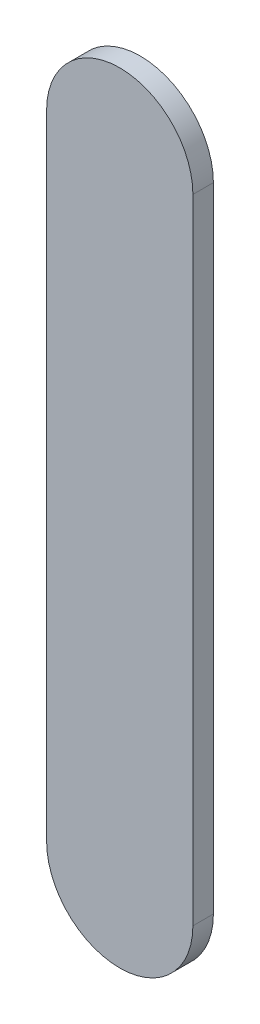
ISO-10303-21;
HEADER;
FILE_DESCRIPTION(('STEP AP214'),'2;1');
FILE_NAME('part.step','',(''),(''),'','','');
FILE_SCHEMA(('AUTOMOTIVE_DESIGN { 1 0 10303 214 1 1 1 1 }'));
ENDSEC;
DATA;
#1=APPLICATION_CONTEXT('core data for automotive mechanical design processes');
#2=APPLICATION_PROTOCOL_DEFINITION('international standard','automotive_design',2000,#1);
#3=PRODUCT_CONTEXT('',#1,'mechanical');
#4=PRODUCT('Part','Part','',(#3));
#5=PRODUCT_RELATED_PRODUCT_CATEGORY('part','',(#4));
#6=PRODUCT_DEFINITION_FORMATION('','',#4);
#7=PRODUCT_DEFINITION_CONTEXT('part definition',#1,'design');
#8=PRODUCT_DEFINITION('design','',#6,#7);
#9=PRODUCT_DEFINITION_SHAPE('','',#8);
#10=(LENGTH_UNIT() NAMED_UNIT(*) SI_UNIT(.MILLI.,.METRE.));
#11=(NAMED_UNIT(*) PLANE_ANGLE_UNIT() SI_UNIT($,.RADIAN.));
#12=(NAMED_UNIT(*) SI_UNIT($,.STERADIAN.) SOLID_ANGLE_UNIT());
#13=UNCERTAINTY_MEASURE_WITH_UNIT(LENGTH_MEASURE(1.E-05),#10,'distance_accuracy_value','');
#14=(GEOMETRIC_REPRESENTATION_CONTEXT(3) GLOBAL_UNCERTAINTY_ASSIGNED_CONTEXT((#13)) GLOBAL_UNIT_ASSIGNED_CONTEXT((#10,
#11,#12)) REPRESENTATION_CONTEXT('',''));
#15=CARTESIAN_POINT('',(0.,0.,0.));
#16=DIRECTION('',(0.,0.,1.));
#17=DIRECTION('',(1.,0.,0.));
#18=AXIS2_PLACEMENT_3D('',#15,#16,#17);
#19=CARTESIAN_POINT('',(96.24397312,86.58697186,0.));
#20=DIRECTION('',(-1.,0.,0.));
#21=DIRECTION('',(0.,1.,0.));
#22=AXIS2_PLACEMENT_3D('',#19,#20,#21);
#23=PLANE('',#22);
#24=DIRECTION('',(0.,1.,0.));
#25=VECTOR('',#24,1.);
#26=CARTESIAN_POINT('',(96.24397312,86.58697186,0.03556));
#27=LINE('',#26,#25);
#28=CARTESIAN_POINT('',(96.24397312,86.58697186,0.03556));
#29=VERTEX_POINT('',#28);
#30=CARTESIAN_POINT('',(96.24397312,87.68686552,0.03556));
#31=VERTEX_POINT('',#30);
#32=EDGE_CURVE('E11',#29,#31,#27,.T.);
#33=ORIENTED_EDGE('',*,*,#32,.F.);
#34=DIRECTION('',(0.,0.,1.));
#35=VECTOR('',#34,1.);
#36=CARTESIAN_POINT('',(96.24397312,86.58697186,0.));
#37=LINE('',#36,#35);
#38=CARTESIAN_POINT('',(96.24397312,86.58697186,0.));
#39=VERTEX_POINT('',#38);
#40=EDGE_CURVE('E24',#39,#29,#37,.T.);
#41=ORIENTED_EDGE('',*,*,#40,.F.);
#42=DIRECTION('',(0.,1.,0.));
#43=VECTOR('',#42,1.);
#44=CARTESIAN_POINT('',(96.24397312,86.58697186,0.));
#45=LINE('',#44,#43);
#46=CARTESIAN_POINT('',(96.24397312,87.68686552,0.));
#47=VERTEX_POINT('',#46);
#48=EDGE_CURVE('E75',#39,#47,#45,.T.);
#49=ORIENTED_EDGE('',*,*,#48,.T.);
#50=DIRECTION('',(0.,0.,1.));
#51=VECTOR('',#50,1.);
#52=CARTESIAN_POINT('',(96.24397312,87.68686552,0.));
#53=LINE('',#52,#51);
#54=EDGE_CURVE('E37',#47,#31,#53,.T.);
#55=ORIENTED_EDGE('',*,*,#54,.T.);
#56=EDGE_LOOP('',(#33,#41,#49,#55));
#57=FACE_BOUND('',#56,.T.);
#58=ADVANCED_FACE('F17',(#57),#23,.F.);
#59=CARTESIAN_POINT('',(96.11697312,87.68686552,0.));
#60=DIRECTION('',(0.,0.,-1.));
#61=DIRECTION('',(1.,0.,0.));
#62=AXIS2_PLACEMENT_3D('',#59,#60,#61);
#63=CYLINDRICAL_SURFACE('',#62,0.127);
#64=CARTESIAN_POINT('',(96.11697312,87.68686552,0.03556));
#65=DIRECTION('',(0.,0.,1.));
#66=DIRECTION('',(1.,0.,0.));
#67=AXIS2_PLACEMENT_3D('',#64,#65,#66);
#68=CIRCLE('',#67,0.127);
#69=CARTESIAN_POINT('',(95.98997312,87.68686552,0.03556));
#70=VERTEX_POINT('',#69);
#71=EDGE_CURVE('E83',#31,#70,#68,.T.);
#72=ORIENTED_EDGE('',*,*,#71,.F.);
#73=ORIENTED_EDGE('',*,*,#54,.F.);
#74=CARTESIAN_POINT('',(96.11697312,87.68686552,0.));
#75=DIRECTION('',(0.,0.,1.));
#76=DIRECTION('',(1.,0.,0.));
#77=AXIS2_PLACEMENT_3D('',#74,#75,#76);
#78=CIRCLE('',#77,0.127);
#79=CARTESIAN_POINT('',(95.98997312,87.68686552,0.));
#80=VERTEX_POINT('',#79);
#81=EDGE_CURVE('E81',#47,#80,#78,.T.);
#82=ORIENTED_EDGE('',*,*,#81,.T.);
#83=DIRECTION('',(0.,0.,1.));
#84=VECTOR('',#83,1.);
#85=CARTESIAN_POINT('',(95.98997312,87.68686552,0.));
#86=LINE('',#85,#84);
#87=EDGE_CURVE('E67',#80,#70,#86,.T.);
#88=ORIENTED_EDGE('',*,*,#87,.T.);
#89=EDGE_LOOP('',(#72,#73,#82,#88));
#90=FACE_BOUND('',#89,.T.);
#91=ADVANCED_FACE('F89',(#90),#63,.T.);
#92=CARTESIAN_POINT('',(95.98997312,87.68686552,0.));
#93=DIRECTION('',(1.,0.,0.));
#94=DIRECTION('',(0.,-1.,0.));
#95=AXIS2_PLACEMENT_3D('',#92,#93,#94);
#96=PLANE('',#95);
#97=DIRECTION('',(0.,-1.,0.));
#98=VECTOR('',#97,1.);
#99=CARTESIAN_POINT('',(95.98997312,87.68686552,0.03556));
#100=LINE('',#99,#98);
#101=CARTESIAN_POINT('',(95.98997312,86.58697186,0.03556));
#102=VERTEX_POINT('',#101);
#103=EDGE_CURVE('E71',#70,#102,#100,.T.);
#104=ORIENTED_EDGE('',*,*,#103,.F.);
#105=ORIENTED_EDGE('',*,*,#87,.F.);
#106=DIRECTION('',(0.,-1.,0.));
#107=VECTOR('',#106,1.);
#108=CARTESIAN_POINT('',(95.98997312,87.68686552,0.));
#109=LINE('',#108,#107);
#110=CARTESIAN_POINT('',(95.98997312,86.58697186,0.));
#111=VERTEX_POINT('',#110);
#112=EDGE_CURVE('E63',#80,#111,#109,.T.);
#113=ORIENTED_EDGE('',*,*,#112,.T.);
#114=DIRECTION('',(0.,0.,1.));
#115=VECTOR('',#114,1.);
#116=CARTESIAN_POINT('',(95.98997312,86.58697186,0.));
#117=LINE('',#116,#115);
#118=EDGE_CURVE('E53',#111,#102,#117,.T.);
#119=ORIENTED_EDGE('',*,*,#118,.T.);
#120=EDGE_LOOP('',(#104,#105,#113,#119));
#121=FACE_BOUND('',#120,.T.);
#122=ADVANCED_FACE('F66',(#121),#96,.F.);
#123=CARTESIAN_POINT('',(96.11697312,86.58697186,0.));
#124=DIRECTION('',(0.,0.,-1.));
#125=DIRECTION('',(-1.,1.11896493820492E-13,0.));
#126=AXIS2_PLACEMENT_3D('',#123,#124,#125);
#127=CYLINDRICAL_SURFACE('',#126,0.127);
#128=CARTESIAN_POINT('',(96.11697312,86.58697186,0.03556));
#129=DIRECTION('',(0.,0.,1.));
#130=DIRECTION('',(-1.,1.11896493820492E-13,0.));
#131=AXIS2_PLACEMENT_3D('',#128,#129,#130);
#132=CIRCLE('',#131,0.127);
#133=EDGE_CURVE('E59',#102,#29,#132,.T.);
#134=ORIENTED_EDGE('',*,*,#133,.F.);
#135=ORIENTED_EDGE('',*,*,#118,.F.);
#136=CARTESIAN_POINT('',(96.11697312,86.58697186,0.));
#137=DIRECTION('',(0.,0.,1.));
#138=DIRECTION('',(-1.,1.11896493820492E-13,0.));
#139=AXIS2_PLACEMENT_3D('',#136,#137,#138);
#140=CIRCLE('',#139,0.127);
#141=EDGE_CURVE('E57',#111,#39,#140,.T.);
#142=ORIENTED_EDGE('',*,*,#141,.T.);
#143=ORIENTED_EDGE('',*,*,#40,.T.);
#144=EDGE_LOOP('',(#134,#135,#142,#143));
#145=FACE_BOUND('',#144,.T.);
#146=ADVANCED_FACE('F55',(#145),#127,.T.);
#147=CARTESIAN_POINT('',(96.24397312,86.58697186,0.));
#148=DIRECTION('',(0.,0.,-1.));
#149=DIRECTION('',(-1.,0.,0.));
#150=AXIS2_PLACEMENT_3D('',#147,#148,#149);
#151=PLANE('',#150);
#152=ORIENTED_EDGE('',*,*,#141,.F.);
#153=ORIENTED_EDGE('',*,*,#112,.F.);
#154=ORIENTED_EDGE('',*,*,#81,.F.);
#155=ORIENTED_EDGE('',*,*,#48,.F.);
#156=EDGE_LOOP('',(#152,#153,#154,#155));
#157=FACE_BOUND('',#156,.T.);
#158=ADVANCED_FACE('F74',(#157),#151,.T.);
#159=CARTESIAN_POINT('',(96.24397312,86.58697186,0.03556));
#160=DIRECTION('',(0.,0.,-1.));
#161=DIRECTION('',(-1.,0.,0.));
#162=AXIS2_PLACEMENT_3D('',#159,#160,#161);
#163=PLANE('',#162);
#164=ORIENTED_EDGE('',*,*,#32,.T.);
#165=ORIENTED_EDGE('',*,*,#71,.T.);
#166=ORIENTED_EDGE('',*,*,#103,.T.);
#167=ORIENTED_EDGE('',*,*,#133,.T.);
#168=EDGE_LOOP('',(#164,#165,#166,#167));
#169=FACE_BOUND('',#168,.T.);
#170=ADVANCED_FACE('F91',(#169),#163,.F.);
#171=CLOSED_SHELL('',(#58,#91,#122,#146,#158,#170));
#172=MANIFOLD_SOLID_BREP('B1',#171);
#173=ADVANCED_BREP_SHAPE_REPRESENTATION('',(#18,#172),#14);
#174=SHAPE_DEFINITION_REPRESENTATION(#9,#173);
ENDSEC;
END-ISO-10303-21;
